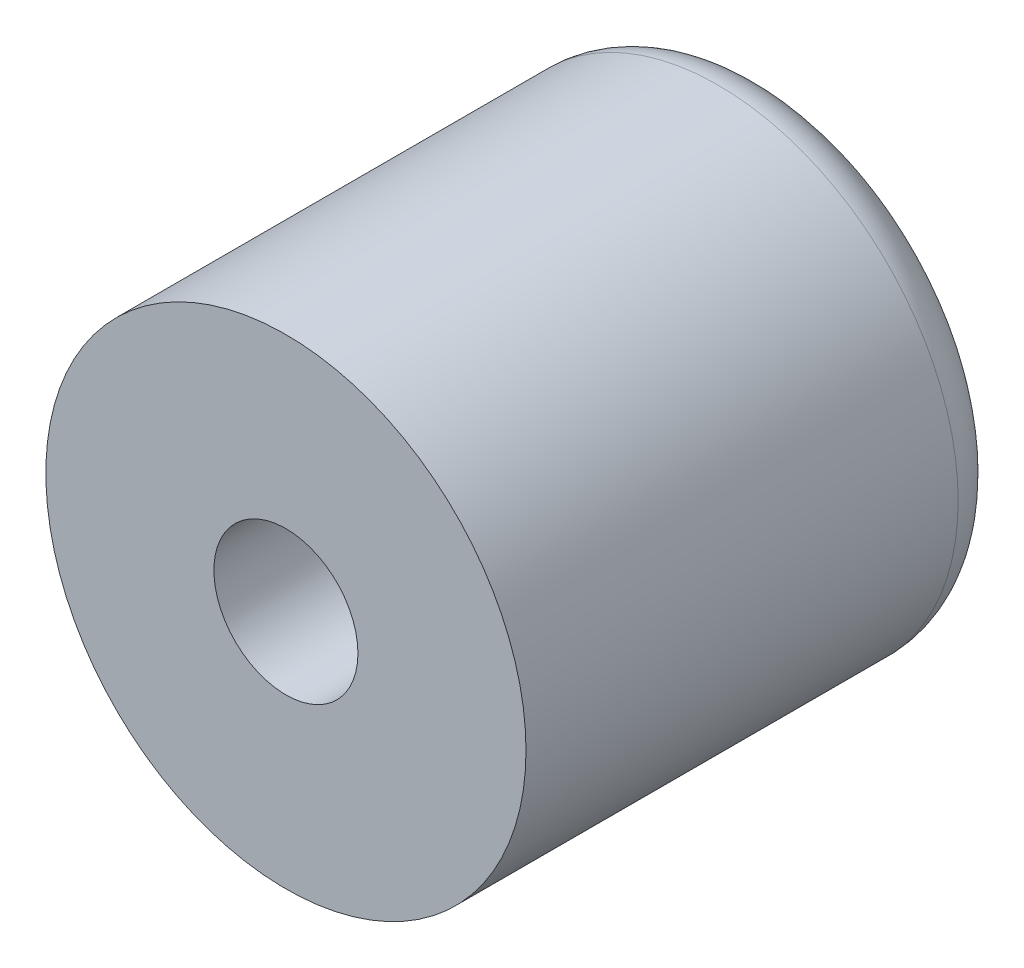
ISO-10303-21;
HEADER;
FILE_DESCRIPTION(('STEP AP214'),'2;1');
FILE_NAME('part.step','',(''),(''),'','','');
FILE_SCHEMA(('AUTOMOTIVE_DESIGN { 1 0 10303 214 1 1 1 1 }'));
ENDSEC;
DATA;
#1=APPLICATION_CONTEXT('core data for automotive mechanical design processes');
#2=APPLICATION_PROTOCOL_DEFINITION('international standard','automotive_design',2000,#1);
#3=PRODUCT_CONTEXT('',#1,'mechanical');
#4=PRODUCT('Part','Part','',(#3));
#5=PRODUCT_RELATED_PRODUCT_CATEGORY('part','',(#4));
#6=PRODUCT_DEFINITION_FORMATION('','',#4);
#7=PRODUCT_DEFINITION_CONTEXT('part definition',#1,'design');
#8=PRODUCT_DEFINITION('design','',#6,#7);
#9=PRODUCT_DEFINITION_SHAPE('','',#8);
#10=(LENGTH_UNIT() NAMED_UNIT(*) SI_UNIT(.MILLI.,.METRE.));
#11=(NAMED_UNIT(*) PLANE_ANGLE_UNIT() SI_UNIT($,.RADIAN.));
#12=(NAMED_UNIT(*) SI_UNIT($,.STERADIAN.) SOLID_ANGLE_UNIT());
#13=UNCERTAINTY_MEASURE_WITH_UNIT(LENGTH_MEASURE(1.E-05),#10,'distance_accuracy_value','');
#14=(GEOMETRIC_REPRESENTATION_CONTEXT(3) GLOBAL_UNCERTAINTY_ASSIGNED_CONTEXT((#13)) GLOBAL_UNIT_ASSIGNED_CONTEXT((#10,
#11,#12)) REPRESENTATION_CONTEXT('',''));
#15=CARTESIAN_POINT('',(0.,0.,0.));
#16=DIRECTION('',(0.,0.,1.));
#17=DIRECTION('',(1.,0.,0.));
#18=AXIS2_PLACEMENT_3D('',#15,#16,#17);
#19=CARTESIAN_POINT('',(0.,0.,10.));
#20=DIRECTION('',(0.,0.,-1.));
#21=DIRECTION('',(-1.,0.,0.));
#22=AXIS2_PLACEMENT_3D('',#19,#20,#21);
#23=CYLINDRICAL_SURFACE('',#22,5.);
#24=CARTESIAN_POINT('',(0.,0.,0.999999999999999));
#25=DIRECTION('',(0.,0.,1.));
#26=DIRECTION('',(1.,0.,0.));
#27=AXIS2_PLACEMENT_3D('',#24,#25,#26);
#28=CIRCLE('',#27,5.);
#29=CARTESIAN_POINT('',(5.,0.,0.999999999999999));
#30=VERTEX_POINT('',#29);
#31=EDGE_CURVE('E44',#30,#30,#28,.T.);
#32=ORIENTED_EDGE('',*,*,#31,.T.);
#33=EDGE_LOOP('',(#32));
#34=FACE_BOUND('',#33,.T.);
#35=CARTESIAN_POINT('',(0.,0.,10.));
#36=DIRECTION('',(0.,0.,1.));
#37=DIRECTION('',(1.,0.,0.));
#38=AXIS2_PLACEMENT_3D('',#35,#36,#37);
#39=CIRCLE('',#38,5.);
#40=CARTESIAN_POINT('',(5.,0.,10.));
#41=VERTEX_POINT('',#40);
#42=EDGE_CURVE('E49',#41,#41,#39,.T.);
#43=ORIENTED_EDGE('',*,*,#42,.F.);
#44=EDGE_LOOP('',(#43));
#45=FACE_BOUND('',#44,.T.);
#46=ADVANCED_FACE('F36',(#34,#45),#23,.T.);
#47=CARTESIAN_POINT('',(0.,0.,10.));
#48=DIRECTION('',(0.,0.,1.));
#49=DIRECTION('',(1.,0.,0.));
#50=AXIS2_PLACEMENT_3D('',#47,#48,#49);
#51=PLANE('',#50);
#52=CARTESIAN_POINT('',(0.,0.,10.));
#53=DIRECTION('',(0.,0.,1.));
#54=DIRECTION('',(1.,0.,0.));
#55=AXIS2_PLACEMENT_3D('',#52,#53,#54);
#56=CIRCLE('',#55,1.5);
#57=CARTESIAN_POINT('',(1.5,0.,10.));
#58=VERTEX_POINT('',#57);
#59=EDGE_CURVE('E60',#58,#58,#56,.T.);
#60=ORIENTED_EDGE('',*,*,#59,.F.);
#61=EDGE_LOOP('',(#60));
#62=FACE_BOUND('',#61,.T.);
#63=ORIENTED_EDGE('',*,*,#42,.T.);
#64=EDGE_LOOP('',(#63));
#65=FACE_BOUND('',#64,.T.);
#66=ADVANCED_FACE('F89',(#62,#65),#51,.T.);
#67=CARTESIAN_POINT('',(0.,0.,0.));
#68=DIRECTION('',(0.,0.,1.));
#69=DIRECTION('',(1.,0.,0.));
#70=AXIS2_PLACEMENT_3D('',#67,#68,#69);
#71=PLANE('',#70);
#72=CARTESIAN_POINT('',(0.,0.,0.));
#73=DIRECTION('',(0.,0.,1.));
#74=DIRECTION('',(1.,0.,0.));
#75=AXIS2_PLACEMENT_3D('',#72,#73,#74);
#76=CIRCLE('',#75,4.);
#77=CARTESIAN_POINT('',(4.,0.,0.));
#78=VERTEX_POINT('',#77);
#79=EDGE_CURVE('E10',#78,#78,#76,.F.);
#80=ORIENTED_EDGE('',*,*,#79,.T.);
#81=EDGE_LOOP('',(#80));
#82=FACE_BOUND('',#81,.T.);
#83=CARTESIAN_POINT('',(0.,0.,0.));
#84=DIRECTION('',(0.,0.,1.));
#85=DIRECTION('',(1.,0.,0.));
#86=AXIS2_PLACEMENT_3D('',#83,#84,#85);
#87=CIRCLE('',#86,1.);
#88=CARTESIAN_POINT('',(1.,0.,0.));
#89=VERTEX_POINT('',#88);
#90=EDGE_CURVE('E57',#89,#89,#87,.T.);
#91=ORIENTED_EDGE('',*,*,#90,.T.);
#92=EDGE_LOOP('',(#91));
#93=FACE_BOUND('',#92,.T.);
#94=ADVANCED_FACE('F85',(#82,#93),#71,.F.);
#95=CARTESIAN_POINT('',(0.,0.,3.));
#96=DIRECTION('',(0.,0.,1.));
#97=DIRECTION('',(1.,0.,0.));
#98=AXIS2_PLACEMENT_3D('',#95,#96,#97);
#99=CYLINDRICAL_SURFACE('',#98,1.5);
#100=CARTESIAN_POINT('',(0.,0.,3.));
#101=DIRECTION('',(0.,0.,1.));
#102=DIRECTION('',(1.,0.,0.));
#103=AXIS2_PLACEMENT_3D('',#100,#101,#102);
#104=CIRCLE('',#103,1.5);
#105=CARTESIAN_POINT('',(1.5,0.,3.));
#106=VERTEX_POINT('',#105);
#107=EDGE_CURVE('E54',#106,#106,#104,.T.);
#108=ORIENTED_EDGE('',*,*,#107,.F.);
#109=EDGE_LOOP('',(#108));
#110=FACE_BOUND('',#109,.T.);
#111=ORIENTED_EDGE('',*,*,#59,.T.);
#112=EDGE_LOOP('',(#111));
#113=FACE_BOUND('',#112,.T.);
#114=ADVANCED_FACE('F79',(#110,#113),#99,.F.);
#115=CARTESIAN_POINT('',(0.,0.,3.));
#116=DIRECTION('',(0.,0.,1.));
#117=DIRECTION('',(1.,0.,0.));
#118=AXIS2_PLACEMENT_3D('',#115,#116,#117);
#119=PLANE('',#118);
#120=CARTESIAN_POINT('',(0.,0.,3.));
#121=DIRECTION('',(0.,0.,1.));
#122=DIRECTION('',(1.,0.,0.));
#123=AXIS2_PLACEMENT_3D('',#120,#121,#122);
#124=CIRCLE('',#123,1.);
#125=CARTESIAN_POINT('',(1.,0.,3.));
#126=VERTEX_POINT('',#125);
#127=EDGE_CURVE('E61',#126,#126,#124,.T.);
#128=ORIENTED_EDGE('',*,*,#127,.F.);
#129=EDGE_LOOP('',(#128));
#130=FACE_BOUND('',#129,.T.);
#131=ORIENTED_EDGE('',*,*,#107,.T.);
#132=EDGE_LOOP('',(#131));
#133=FACE_BOUND('',#132,.T.);
#134=ADVANCED_FACE('F76',(#130,#133),#119,.T.);
#135=CARTESIAN_POINT('',(0.,0.,-4.));
#136=DIRECTION('',(0.,0.,1.));
#137=DIRECTION('',(1.,0.,0.));
#138=AXIS2_PLACEMENT_3D('',#135,#136,#137);
#139=CYLINDRICAL_SURFACE('',#138,1.);
#140=ORIENTED_EDGE('',*,*,#127,.T.);
#141=EDGE_LOOP('',(#140));
#142=FACE_BOUND('',#141,.T.);
#143=ORIENTED_EDGE('',*,*,#90,.F.);
#144=EDGE_LOOP('',(#143));
#145=FACE_BOUND('',#144,.T.);
#146=ADVANCED_FACE('F73',(#142,#145),#139,.F.);
#147=CARTESIAN_POINT('',(0.,0.,0.999999999999999));
#148=DIRECTION('',(0.,0.,1.));
#149=DIRECTION('',(1.,0.,0.));
#150=AXIS2_PLACEMENT_3D('',#147,#148,#149);
#151=TOROIDAL_SURFACE('',#150,4.,1.);
#152=ORIENTED_EDGE('',*,*,#79,.F.);
#153=EDGE_LOOP('',(#152));
#154=FACE_BOUND('',#153,.T.);
#155=ORIENTED_EDGE('',*,*,#31,.F.);
#156=EDGE_LOOP('',(#155));
#157=FACE_BOUND('',#156,.T.);
#158=ADVANCED_FACE('F38',(#154,#157),#151,.T.);
#159=CLOSED_SHELL('',(#46,#66,#94,#114,#134,#146,#158));
#160=MANIFOLD_SOLID_BREP('B2',#159);
#161=ADVANCED_BREP_SHAPE_REPRESENTATION('',(#18,#160),#14);
#162=SHAPE_DEFINITION_REPRESENTATION(#9,#161);
ENDSEC;
END-ISO-10303-21;
